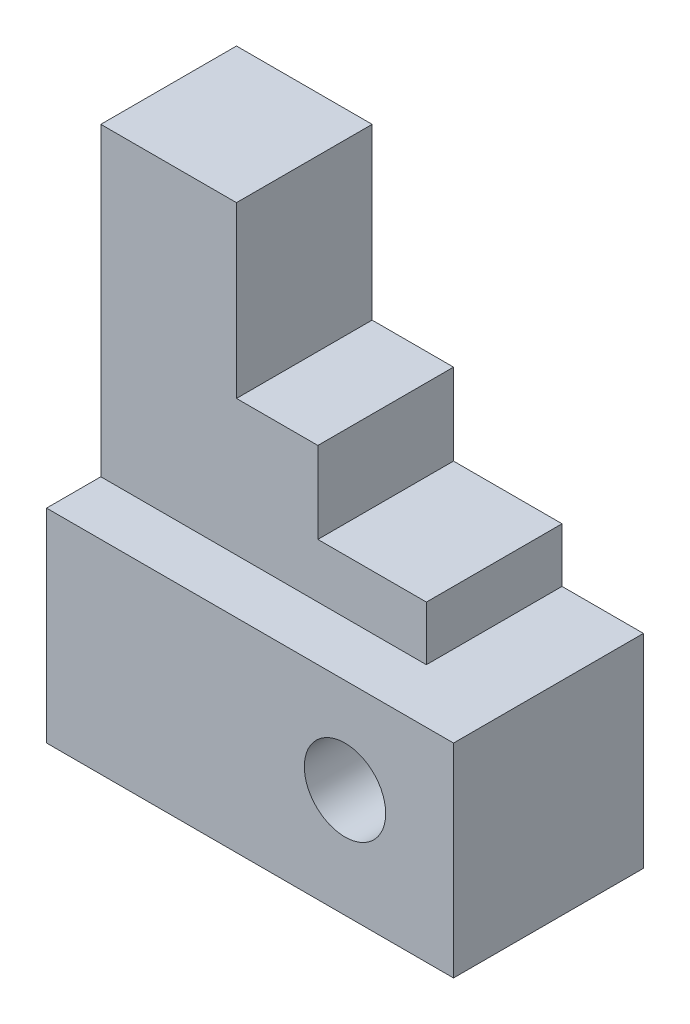
ISO-10303-21;
HEADER;
FILE_DESCRIPTION(('STEP AP214'),'2;1');
FILE_NAME('part.step','',(''),(''),'','','');
FILE_SCHEMA(('AUTOMOTIVE_DESIGN { 1 0 10303 214 1 1 1 1 }'));
ENDSEC;
DATA;
#1=APPLICATION_CONTEXT('core data for automotive mechanical design processes');
#2=APPLICATION_PROTOCOL_DEFINITION('international standard','automotive_design',2000,#1);
#3=PRODUCT_CONTEXT('',#1,'mechanical');
#4=PRODUCT('Part','Part','',(#3));
#5=PRODUCT_RELATED_PRODUCT_CATEGORY('part','',(#4));
#6=PRODUCT_DEFINITION_FORMATION('','',#4);
#7=PRODUCT_DEFINITION_CONTEXT('part definition',#1,'design');
#8=PRODUCT_DEFINITION('design','',#6,#7);
#9=PRODUCT_DEFINITION_SHAPE('','',#8);
#10=(LENGTH_UNIT() NAMED_UNIT(*) SI_UNIT(.MILLI.,.METRE.));
#11=(NAMED_UNIT(*) PLANE_ANGLE_UNIT() SI_UNIT($,.RADIAN.));
#12=(NAMED_UNIT(*) SI_UNIT($,.STERADIAN.) SOLID_ANGLE_UNIT());
#13=UNCERTAINTY_MEASURE_WITH_UNIT(LENGTH_MEASURE(1.E-05),#10,'distance_accuracy_value','');
#14=(GEOMETRIC_REPRESENTATION_CONTEXT(3) GLOBAL_UNCERTAINTY_ASSIGNED_CONTEXT((#13)) GLOBAL_UNIT_ASSIGNED_CONTEXT((#10,
#11,#12)) REPRESENTATION_CONTEXT('',''));
#15=CARTESIAN_POINT('',(0.,0.,0.));
#16=DIRECTION('',(0.,0.,1.));
#17=DIRECTION('',(1.,0.,0.));
#18=AXIS2_PLACEMENT_3D('',#15,#16,#17);
#19=CARTESIAN_POINT('',(0.,30.,28.));
#20=DIRECTION('',(0.,-1.,0.));
#21=DIRECTION('',(1.,0.,0.));
#22=AXIS2_PLACEMENT_3D('',#19,#20,#21);
#23=PLANE('',#22);
#24=DIRECTION('',(0.,0.,-1.));
#25=VECTOR('',#24,1.);
#26=CARTESIAN_POINT('',(48.,30.,20.));
#27=LINE('',#26,#25);
#28=CARTESIAN_POINT('',(48.,30.,20.));
#29=VERTEX_POINT('',#28);
#30=CARTESIAN_POINT('',(48.,30.,0.));
#31=VERTEX_POINT('',#30);
#32=EDGE_CURVE('E182',#29,#31,#27,.T.);
#33=ORIENTED_EDGE('',*,*,#32,.F.);
#34=DIRECTION('',(-1.,0.,0.));
#35=VECTOR('',#34,1.);
#36=CARTESIAN_POINT('',(0.,30.,20.));
#37=LINE('',#36,#35);
#38=CARTESIAN_POINT('',(0.,30.,20.));
#39=VERTEX_POINT('',#38);
#40=EDGE_CURVE('E154',#29,#39,#37,.T.);
#41=ORIENTED_EDGE('',*,*,#40,.T.);
#42=DIRECTION('',(0.,0.,-1.));
#43=VECTOR('',#42,1.);
#44=CARTESIAN_POINT('',(0.,30.,28.));
#45=LINE('',#44,#43);
#46=CARTESIAN_POINT('',(0.,30.,28.));
#47=VERTEX_POINT('',#46);
#48=EDGE_CURVE('E11',#47,#39,#45,.T.);
#49=ORIENTED_EDGE('',*,*,#48,.F.);
#50=DIRECTION('',(-1.,0.,0.));
#51=VECTOR('',#50,1.);
#52=CARTESIAN_POINT('',(0.,30.,28.));
#53=LINE('',#52,#51);
#54=CARTESIAN_POINT('',(60.,30.,28.));
#55=VERTEX_POINT('',#54);
#56=EDGE_CURVE('E224',#55,#47,#53,.T.);
#57=ORIENTED_EDGE('',*,*,#56,.F.);
#58=DIRECTION('',(0.,0.,-1.));
#59=VECTOR('',#58,1.);
#60=CARTESIAN_POINT('',(60.,30.,28.));
#61=LINE('',#60,#59);
#62=CARTESIAN_POINT('',(60.,30.,0.));
#63=VERTEX_POINT('',#62);
#64=EDGE_CURVE('E234',#55,#63,#61,.T.);
#65=ORIENTED_EDGE('',*,*,#64,.T.);
#66=DIRECTION('',(-1.,0.,0.));
#67=VECTOR('',#66,1.);
#68=CARTESIAN_POINT('',(0.,30.,0.));
#69=LINE('',#68,#67);
#70=EDGE_CURVE('E238',#63,#31,#69,.T.);
#71=ORIENTED_EDGE('',*,*,#70,.T.);
#72=EDGE_LOOP('',(#33,#41,#49,#57,#65,#71));
#73=FACE_BOUND('',#72,.T.);
#74=ADVANCED_FACE('F41',(#73),#23,.F.);
#75=CARTESIAN_POINT('',(0.,0.,28.));
#76=DIRECTION('',(1.,0.,0.));
#77=DIRECTION('',(0.,0.,-1.));
#78=AXIS2_PLACEMENT_3D('',#75,#76,#77);
#79=PLANE('',#78);
#80=DIRECTION('',(0.,-1.,0.));
#81=VECTOR('',#80,1.);
#82=CARTESIAN_POINT('',(0.,0.,0.));
#83=LINE('',#82,#81);
#84=CARTESIAN_POINT('',(0.,75.,0.));
#85=VERTEX_POINT('',#84);
#86=CARTESIAN_POINT('',(0.,0.,0.));
#87=VERTEX_POINT('',#86);
#88=EDGE_CURVE('E242',#85,#87,#83,.T.);
#89=ORIENTED_EDGE('',*,*,#88,.T.);
#90=DIRECTION('',(0.,0.,-1.));
#91=VECTOR('',#90,1.);
#92=CARTESIAN_POINT('',(0.,0.,28.));
#93=LINE('',#92,#91);
#94=CARTESIAN_POINT('',(0.,0.,28.));
#95=VERTEX_POINT('',#94);
#96=EDGE_CURVE('E50',#95,#87,#93,.T.);
#97=ORIENTED_EDGE('',*,*,#96,.F.);
#98=DIRECTION('',(0.,-1.,0.));
#99=VECTOR('',#98,1.);
#100=CARTESIAN_POINT('',(0.,0.,28.));
#101=LINE('',#100,#99);
#102=EDGE_CURVE('E91',#47,#95,#101,.T.);
#103=ORIENTED_EDGE('',*,*,#102,.F.);
#104=ORIENTED_EDGE('',*,*,#48,.T.);
#105=DIRECTION('',(0.,1.,0.));
#106=VECTOR('',#105,1.);
#107=CARTESIAN_POINT('',(0.,0.,20.));
#108=LINE('',#107,#106);
#109=CARTESIAN_POINT('',(0.,75.,20.));
#110=VERTEX_POINT('',#109);
#111=EDGE_CURVE('E57',#39,#110,#108,.T.);
#112=ORIENTED_EDGE('',*,*,#111,.T.);
#113=DIRECTION('',(0.,0.,-1.));
#114=VECTOR('',#113,1.);
#115=CARTESIAN_POINT('',(0.,75.,20.));
#116=LINE('',#115,#114);
#117=EDGE_CURVE('E205',#110,#85,#116,.T.);
#118=ORIENTED_EDGE('',*,*,#117,.T.);
#119=EDGE_LOOP('',(#89,#97,#103,#104,#112,#118));
#120=FACE_BOUND('',#119,.T.);
#121=ADVANCED_FACE('F281',(#120),#79,.F.);
#122=CARTESIAN_POINT('',(0.,0.,28.));
#123=DIRECTION('',(0.,1.,0.));
#124=DIRECTION('',(0.,0.,1.));
#125=AXIS2_PLACEMENT_3D('',#122,#123,#124);
#126=PLANE('',#125);
#127=DIRECTION('',(1.,0.,0.));
#128=VECTOR('',#127,1.);
#129=CARTESIAN_POINT('',(0.,0.,0.));
#130=LINE('',#129,#128);
#131=CARTESIAN_POINT('',(60.,0.,0.));
#132=VERTEX_POINT('',#131);
#133=EDGE_CURVE('E245',#87,#132,#130,.T.);
#134=ORIENTED_EDGE('',*,*,#133,.T.);
#135=DIRECTION('',(0.,0.,-1.));
#136=VECTOR('',#135,1.);
#137=CARTESIAN_POINT('',(60.,0.,28.));
#138=LINE('',#137,#136);
#139=CARTESIAN_POINT('',(60.,0.,28.));
#140=VERTEX_POINT('',#139);
#141=EDGE_CURVE('E252',#140,#132,#138,.T.);
#142=ORIENTED_EDGE('',*,*,#141,.F.);
#143=DIRECTION('',(1.,0.,0.));
#144=VECTOR('',#143,1.);
#145=CARTESIAN_POINT('',(0.,0.,28.));
#146=LINE('',#145,#144);
#147=EDGE_CURVE('E229',#95,#140,#146,.T.);
#148=ORIENTED_EDGE('',*,*,#147,.F.);
#149=ORIENTED_EDGE('',*,*,#96,.T.);
#150=EDGE_LOOP('',(#134,#142,#148,#149));
#151=FACE_BOUND('',#150,.T.);
#152=ADVANCED_FACE('F259',(#151),#126,.F.);
#153=CARTESIAN_POINT('',(44.,16.,28.));
#154=DIRECTION('',(0.,0.,-1.));
#155=DIRECTION('',(-1.,0.,0.));
#156=AXIS2_PLACEMENT_3D('',#153,#154,#155);
#157=CYLINDRICAL_SURFACE('',#156,6.00000000000001);
#158=CARTESIAN_POINT('',(44.,16.,28.));
#159=DIRECTION('',(0.,0.,1.));
#160=DIRECTION('',(1.,0.,0.));
#161=AXIS2_PLACEMENT_3D('',#158,#159,#160);
#162=CIRCLE('',#161,6.00000000000001);
#163=CARTESIAN_POINT('',(50.,16.,28.));
#164=VERTEX_POINT('',#163);
#165=EDGE_CURVE('E220',#164,#164,#162,.T.);
#166=ORIENTED_EDGE('',*,*,#165,.T.);
#167=EDGE_LOOP('',(#166));
#168=FACE_BOUND('',#167,.T.);
#169=CARTESIAN_POINT('',(44.,16.,0.));
#170=DIRECTION('',(0.,0.,1.));
#171=DIRECTION('',(1.,0.,0.));
#172=AXIS2_PLACEMENT_3D('',#169,#170,#171);
#173=CIRCLE('',#172,6.00000000000001);
#174=CARTESIAN_POINT('',(50.,16.,0.));
#175=VERTEX_POINT('',#174);
#176=EDGE_CURVE('E146',#175,#175,#173,.T.);
#177=ORIENTED_EDGE('',*,*,#176,.F.);
#178=EDGE_LOOP('',(#177));
#179=FACE_BOUND('',#178,.T.);
#180=ADVANCED_FACE('F43',(#168,#179),#157,.F.);
#181=CARTESIAN_POINT('',(60.,0.,28.));
#182=DIRECTION('',(-1.,0.,0.));
#183=DIRECTION('',(0.,0.,1.));
#184=AXIS2_PLACEMENT_3D('',#181,#182,#183);
#185=PLANE('',#184);
#186=DIRECTION('',(0.,1.,0.));
#187=VECTOR('',#186,1.);
#188=CARTESIAN_POINT('',(60.,0.,0.));
#189=LINE('',#188,#187);
#190=EDGE_CURVE('E84',#132,#63,#189,.T.);
#191=ORIENTED_EDGE('',*,*,#190,.T.);
#192=ORIENTED_EDGE('',*,*,#64,.F.);
#193=DIRECTION('',(0.,1.,0.));
#194=VECTOR('',#193,1.);
#195=CARTESIAN_POINT('',(60.,0.,28.));
#196=LINE('',#195,#194);
#197=EDGE_CURVE('E66',#140,#55,#196,.T.);
#198=ORIENTED_EDGE('',*,*,#197,.F.);
#199=ORIENTED_EDGE('',*,*,#141,.T.);
#200=EDGE_LOOP('',(#191,#192,#198,#199));
#201=FACE_BOUND('',#200,.T.);
#202=ADVANCED_FACE('F267',(#201),#185,.F.);
#203=CARTESIAN_POINT('',(0.,0.,28.));
#204=DIRECTION('',(0.,0.,1.));
#205=DIRECTION('',(1.,0.,0.));
#206=AXIS2_PLACEMENT_3D('',#203,#204,#205);
#207=PLANE('',#206);
#208=ORIENTED_EDGE('',*,*,#165,.F.);
#209=EDGE_LOOP('',(#208));
#210=FACE_BOUND('',#209,.T.);
#211=ORIENTED_EDGE('',*,*,#56,.T.);
#212=ORIENTED_EDGE('',*,*,#102,.T.);
#213=ORIENTED_EDGE('',*,*,#147,.T.);
#214=ORIENTED_EDGE('',*,*,#197,.T.);
#215=EDGE_LOOP('',(#211,#212,#213,#214));
#216=FACE_BOUND('',#215,.T.);
#217=ADVANCED_FACE('F269',(#210,#216),#207,.T.);
#218=CARTESIAN_POINT('',(0.,0.,0.));
#219=DIRECTION('',(0.,0.,1.));
#220=DIRECTION('',(1.,0.,0.));
#221=AXIS2_PLACEMENT_3D('',#218,#219,#220);
#222=PLANE('',#221);
#223=ORIENTED_EDGE('',*,*,#176,.T.);
#224=EDGE_LOOP('',(#223));
#225=FACE_BOUND('',#224,.T.);
#226=ORIENTED_EDGE('',*,*,#70,.F.);
#227=ORIENTED_EDGE('',*,*,#190,.F.);
#228=ORIENTED_EDGE('',*,*,#133,.F.);
#229=ORIENTED_EDGE('',*,*,#88,.F.);
#230=DIRECTION('',(1.,0.,0.));
#231=VECTOR('',#230,1.);
#232=CARTESIAN_POINT('',(0.,75.,0.));
#233=LINE('',#232,#231);
#234=CARTESIAN_POINT('',(20.,75.,0.));
#235=VERTEX_POINT('',#234);
#236=EDGE_CURVE('E157',#85,#235,#233,.T.);
#237=ORIENTED_EDGE('',*,*,#236,.T.);
#238=DIRECTION('',(0.,-1.,0.));
#239=VECTOR('',#238,1.);
#240=CARTESIAN_POINT('',(20.,0.,0.));
#241=LINE('',#240,#239);
#242=CARTESIAN_POINT('',(20.,50.,0.));
#243=VERTEX_POINT('',#242);
#244=EDGE_CURVE('E196',#235,#243,#241,.T.);
#245=ORIENTED_EDGE('',*,*,#244,.T.);
#246=DIRECTION('',(1.,0.,0.));
#247=VECTOR('',#246,1.);
#248=CARTESIAN_POINT('',(0.,50.,0.));
#249=LINE('',#248,#247);
#250=CARTESIAN_POINT('',(32.,50.,0.));
#251=VERTEX_POINT('',#250);
#252=EDGE_CURVE('E192',#243,#251,#249,.T.);
#253=ORIENTED_EDGE('',*,*,#252,.T.);
#254=DIRECTION('',(0.,-1.,0.));
#255=VECTOR('',#254,1.);
#256=CARTESIAN_POINT('',(32.,0.,0.));
#257=LINE('',#256,#255);
#258=CARTESIAN_POINT('',(32.,38.,0.));
#259=VERTEX_POINT('',#258);
#260=EDGE_CURVE('E188',#251,#259,#257,.T.);
#261=ORIENTED_EDGE('',*,*,#260,.T.);
#262=DIRECTION('',(1.,0.,0.));
#263=VECTOR('',#262,1.);
#264=CARTESIAN_POINT('',(0.,38.,0.));
#265=LINE('',#264,#263);
#266=CARTESIAN_POINT('',(48.,38.,0.));
#267=VERTEX_POINT('',#266);
#268=EDGE_CURVE('E185',#259,#267,#265,.T.);
#269=ORIENTED_EDGE('',*,*,#268,.T.);
#270=DIRECTION('',(0.,-1.,0.));
#271=VECTOR('',#270,1.);
#272=CARTESIAN_POINT('',(48.,0.,0.));
#273=LINE('',#272,#271);
#274=EDGE_CURVE('E140',#267,#31,#273,.T.);
#275=ORIENTED_EDGE('',*,*,#274,.T.);
#276=EDGE_LOOP('',(#226,#227,#228,#229,#237,#245,#253,#261,#269,#275));
#277=FACE_BOUND('',#276,.T.);
#278=ADVANCED_FACE('F263',(#225,#277),#222,.F.);
#279=CARTESIAN_POINT('',(48.,0.,20.));
#280=DIRECTION('',(1.,0.,0.));
#281=DIRECTION('',(0.,0.,-1.));
#282=AXIS2_PLACEMENT_3D('',#279,#280,#281);
#283=PLANE('',#282);
#284=ORIENTED_EDGE('',*,*,#274,.F.);
#285=DIRECTION('',(0.,0.,-1.));
#286=VECTOR('',#285,1.);
#287=CARTESIAN_POINT('',(48.,38.,20.));
#288=LINE('',#287,#286);
#289=CARTESIAN_POINT('',(48.,38.,20.));
#290=VERTEX_POINT('',#289);
#291=EDGE_CURVE('E135',#290,#267,#288,.T.);
#292=ORIENTED_EDGE('',*,*,#291,.F.);
#293=DIRECTION('',(0.,-1.,0.));
#294=VECTOR('',#293,1.);
#295=CARTESIAN_POINT('',(48.,0.,20.));
#296=LINE('',#295,#294);
#297=EDGE_CURVE('E138',#290,#29,#296,.T.);
#298=ORIENTED_EDGE('',*,*,#297,.T.);
#299=ORIENTED_EDGE('',*,*,#32,.T.);
#300=EDGE_LOOP('',(#284,#292,#298,#299));
#301=FACE_BOUND('',#300,.T.);
#302=ADVANCED_FACE('F137',(#301),#283,.T.);
#303=CARTESIAN_POINT('',(0.,38.,20.));
#304=DIRECTION('',(0.,1.,0.));
#305=DIRECTION('',(0.,0.,1.));
#306=AXIS2_PLACEMENT_3D('',#303,#304,#305);
#307=PLANE('',#306);
#308=ORIENTED_EDGE('',*,*,#268,.F.);
#309=DIRECTION('',(0.,0.,-1.));
#310=VECTOR('',#309,1.);
#311=CARTESIAN_POINT('',(32.,38.,20.));
#312=LINE('',#311,#310);
#313=CARTESIAN_POINT('',(32.,38.,20.));
#314=VERTEX_POINT('',#313);
#315=EDGE_CURVE('E147',#314,#259,#312,.T.);
#316=ORIENTED_EDGE('',*,*,#315,.F.);
#317=DIRECTION('',(1.,0.,0.));
#318=VECTOR('',#317,1.);
#319=CARTESIAN_POINT('',(0.,38.,20.));
#320=LINE('',#319,#318);
#321=EDGE_CURVE('E152',#314,#290,#320,.T.);
#322=ORIENTED_EDGE('',*,*,#321,.T.);
#323=ORIENTED_EDGE('',*,*,#291,.T.);
#324=EDGE_LOOP('',(#308,#316,#322,#323));
#325=FACE_BOUND('',#324,.T.);
#326=ADVANCED_FACE('F159',(#325),#307,.T.);
#327=CARTESIAN_POINT('',(32.,0.,20.));
#328=DIRECTION('',(1.,0.,0.));
#329=DIRECTION('',(0.,0.,-1.));
#330=AXIS2_PLACEMENT_3D('',#327,#328,#329);
#331=PLANE('',#330);
#332=ORIENTED_EDGE('',*,*,#260,.F.);
#333=DIRECTION('',(0.,0.,-1.));
#334=VECTOR('',#333,1.);
#335=CARTESIAN_POINT('',(32.,50.,20.));
#336=LINE('',#335,#334);
#337=CARTESIAN_POINT('',(32.,50.,20.));
#338=VERTEX_POINT('',#337);
#339=EDGE_CURVE('E215',#338,#251,#336,.T.);
#340=ORIENTED_EDGE('',*,*,#339,.F.);
#341=DIRECTION('',(0.,-1.,0.));
#342=VECTOR('',#341,1.);
#343=CARTESIAN_POINT('',(32.,0.,20.));
#344=LINE('',#343,#342);
#345=EDGE_CURVE('E161',#338,#314,#344,.T.);
#346=ORIENTED_EDGE('',*,*,#345,.T.);
#347=ORIENTED_EDGE('',*,*,#315,.T.);
#348=EDGE_LOOP('',(#332,#340,#346,#347));
#349=FACE_BOUND('',#348,.T.);
#350=ADVANCED_FACE('F341',(#349),#331,.T.);
#351=CARTESIAN_POINT('',(0.,50.,20.));
#352=DIRECTION('',(0.,1.,0.));
#353=DIRECTION('',(-1.,0.,0.));
#354=AXIS2_PLACEMENT_3D('',#351,#352,#353);
#355=PLANE('',#354);
#356=ORIENTED_EDGE('',*,*,#252,.F.);
#357=DIRECTION('',(0.,0.,-1.));
#358=VECTOR('',#357,1.);
#359=CARTESIAN_POINT('',(20.,50.,20.));
#360=LINE('',#359,#358);
#361=CARTESIAN_POINT('',(20.,50.,20.));
#362=VERTEX_POINT('',#361);
#363=EDGE_CURVE('E212',#362,#243,#360,.T.);
#364=ORIENTED_EDGE('',*,*,#363,.F.);
#365=DIRECTION('',(1.,0.,0.));
#366=VECTOR('',#365,1.);
#367=CARTESIAN_POINT('',(0.,50.,20.));
#368=LINE('',#367,#366);
#369=EDGE_CURVE('E164',#362,#338,#368,.T.);
#370=ORIENTED_EDGE('',*,*,#369,.T.);
#371=ORIENTED_EDGE('',*,*,#339,.T.);
#372=EDGE_LOOP('',(#356,#364,#370,#371));
#373=FACE_BOUND('',#372,.T.);
#374=ADVANCED_FACE('F350',(#373),#355,.T.);
#375=CARTESIAN_POINT('',(20.,0.,20.));
#376=DIRECTION('',(1.,0.,0.));
#377=DIRECTION('',(0.,1.,0.));
#378=AXIS2_PLACEMENT_3D('',#375,#376,#377);
#379=PLANE('',#378);
#380=ORIENTED_EDGE('',*,*,#244,.F.);
#381=DIRECTION('',(0.,0.,-1.));
#382=VECTOR('',#381,1.);
#383=CARTESIAN_POINT('',(20.,75.,20.));
#384=LINE('',#383,#382);
#385=CARTESIAN_POINT('',(20.,75.,20.));
#386=VERTEX_POINT('',#385);
#387=EDGE_CURVE('E209',#386,#235,#384,.T.);
#388=ORIENTED_EDGE('',*,*,#387,.F.);
#389=DIRECTION('',(0.,-1.,0.));
#390=VECTOR('',#389,1.);
#391=CARTESIAN_POINT('',(20.,0.,20.));
#392=LINE('',#391,#390);
#393=EDGE_CURVE('E170',#386,#362,#392,.T.);
#394=ORIENTED_EDGE('',*,*,#393,.T.);
#395=ORIENTED_EDGE('',*,*,#363,.T.);
#396=EDGE_LOOP('',(#380,#388,#394,#395));
#397=FACE_BOUND('',#396,.T.);
#398=ADVANCED_FACE('F360',(#397),#379,.T.);
#399=CARTESIAN_POINT('',(0.,75.,20.));
#400=DIRECTION('',(0.,1.,0.));
#401=DIRECTION('',(0.,0.,1.));
#402=AXIS2_PLACEMENT_3D('',#399,#400,#401);
#403=PLANE('',#402);
#404=ORIENTED_EDGE('',*,*,#236,.F.);
#405=ORIENTED_EDGE('',*,*,#117,.F.);
#406=DIRECTION('',(1.,0.,0.));
#407=VECTOR('',#406,1.);
#408=CARTESIAN_POINT('',(0.,75.,20.));
#409=LINE('',#408,#407);
#410=EDGE_CURVE('E174',#110,#386,#409,.T.);
#411=ORIENTED_EDGE('',*,*,#410,.T.);
#412=ORIENTED_EDGE('',*,*,#387,.T.);
#413=EDGE_LOOP('',(#404,#405,#411,#412));
#414=FACE_BOUND('',#413,.T.);
#415=ADVANCED_FACE('F370',(#414),#403,.T.);
#416=CARTESIAN_POINT('',(0.,0.,20.));
#417=DIRECTION('',(0.,0.,1.));
#418=DIRECTION('',(1.,0.,0.));
#419=AXIS2_PLACEMENT_3D('',#416,#417,#418);
#420=PLANE('',#419);
#421=ORIENTED_EDGE('',*,*,#297,.F.);
#422=ORIENTED_EDGE('',*,*,#321,.F.);
#423=ORIENTED_EDGE('',*,*,#345,.F.);
#424=ORIENTED_EDGE('',*,*,#369,.F.);
#425=ORIENTED_EDGE('',*,*,#393,.F.);
#426=ORIENTED_EDGE('',*,*,#410,.F.);
#427=ORIENTED_EDGE('',*,*,#111,.F.);
#428=ORIENTED_EDGE('',*,*,#40,.F.);
#429=EDGE_LOOP('',(#421,#422,#423,#424,#425,#426,#427,#428));
#430=FACE_BOUND('',#429,.T.);
#431=ADVANCED_FACE('F150',(#430),#420,.T.);
#432=CLOSED_SHELL('',(#74,#121,#152,#180,#202,#217,#278,#302,#326,#350,#374,#398,#415,#431));
#433=MANIFOLD_SOLID_BREP('B2',#432);
#434=ADVANCED_BREP_SHAPE_REPRESENTATION('',(#18,#433),#14);
#435=SHAPE_DEFINITION_REPRESENTATION(#9,#434);
ENDSEC;
END-ISO-10303-21;
